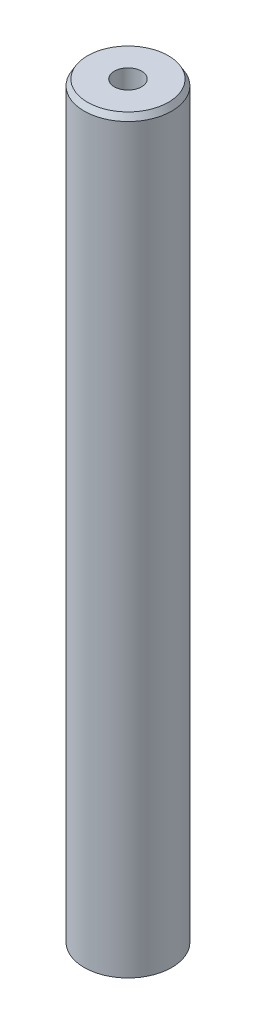
ISO-10303-21;
HEADER;
FILE_DESCRIPTION(('STEP AP214'),'2;1');
FILE_NAME('part.step','',(''),(''),'','','');
FILE_SCHEMA(('AUTOMOTIVE_DESIGN { 1 0 10303 214 1 1 1 1 }'));
ENDSEC;
DATA;
#1=APPLICATION_CONTEXT('core data for automotive mechanical design processes');
#2=APPLICATION_PROTOCOL_DEFINITION('international standard','automotive_design',2000,#1);
#3=PRODUCT_CONTEXT('',#1,'mechanical');
#4=PRODUCT('Part','Part','',(#3));
#5=PRODUCT_RELATED_PRODUCT_CATEGORY('part','',(#4));
#6=PRODUCT_DEFINITION_FORMATION('','',#4);
#7=PRODUCT_DEFINITION_CONTEXT('part definition',#1,'design');
#8=PRODUCT_DEFINITION('design','',#6,#7);
#9=PRODUCT_DEFINITION_SHAPE('','',#8);
#10=(LENGTH_UNIT() NAMED_UNIT(*) SI_UNIT(.MILLI.,.METRE.));
#11=(NAMED_UNIT(*) PLANE_ANGLE_UNIT() SI_UNIT($,.RADIAN.));
#12=(NAMED_UNIT(*) SI_UNIT($,.STERADIAN.) SOLID_ANGLE_UNIT());
#13=UNCERTAINTY_MEASURE_WITH_UNIT(LENGTH_MEASURE(1.E-05),#10,'distance_accuracy_value','');
#14=(GEOMETRIC_REPRESENTATION_CONTEXT(3) GLOBAL_UNCERTAINTY_ASSIGNED_CONTEXT((#13)) GLOBAL_UNIT_ASSIGNED_CONTEXT((#10,
#11,#12)) REPRESENTATION_CONTEXT('',''));
#15=CARTESIAN_POINT('',(0.,0.,0.));
#16=DIRECTION('',(0.,0.,1.));
#17=DIRECTION('',(1.,0.,0.));
#18=AXIS2_PLACEMENT_3D('',#15,#16,#17);
#19=CARTESIAN_POINT('',(0.,600.,0.));
#20=DIRECTION('',(0.,-1.,0.));
#21=DIRECTION('',(0.,0.,-1.));
#22=AXIS2_PLACEMENT_3D('',#19,#20,#21);
#23=CYLINDRICAL_SURFACE('',#22,35.);
#24=CARTESIAN_POINT('',(0.,595.276985216167,0.));
#25=DIRECTION('',(0.,1.,0.));
#26=DIRECTION('',(0.,0.,1.));
#27=AXIS2_PLACEMENT_3D('',#24,#25,#26);
#28=CIRCLE('',#27,35.);
#29=CARTESIAN_POINT('',(0.,595.276985216167,35.));
#30=VERTEX_POINT('',#29);
#31=EDGE_CURVE('E50',#30,#30,#28,.F.);
#32=ORIENTED_EDGE('',*,*,#31,.T.);
#33=EDGE_LOOP('',(#32));
#34=FACE_BOUND('',#33,.T.);
#35=CARTESIAN_POINT('',(0.,2.7268338568327,0.));
#36=DIRECTION('',(0.,1.,0.));
#37=DIRECTION('',(0.,0.,1.));
#38=AXIS2_PLACEMENT_3D('',#35,#36,#37);
#39=CIRCLE('',#38,35.);
#40=CARTESIAN_POINT('',(0.,2.7268338568327,35.));
#41=VERTEX_POINT('',#40);
#42=EDGE_CURVE('E51',#41,#41,#39,.T.);
#43=ORIENTED_EDGE('',*,*,#42,.T.);
#44=EDGE_LOOP('',(#43));
#45=FACE_BOUND('',#44,.T.);
#46=ADVANCED_FACE('F39',(#34,#45),#23,.T.);
#47=CARTESIAN_POINT('',(0.,600.,0.));
#48=DIRECTION('',(0.,1.,0.));
#49=DIRECTION('',(0.,0.,1.));
#50=AXIS2_PLACEMENT_3D('',#47,#48,#49);
#51=PLANE('',#50);
#52=CARTESIAN_POINT('',(0.,600.,0.));
#53=DIRECTION('',(0.,1.,0.));
#54=DIRECTION('',(0.,0.,1.));
#55=AXIS2_PLACEMENT_3D('',#52,#53,#54);
#56=CIRCLE('',#55,32.2731661431673);
#57=CARTESIAN_POINT('',(0.,600.,32.2731661431673));
#58=VERTEX_POINT('',#57);
#59=EDGE_CURVE('E54',#58,#58,#56,.T.);
#60=ORIENTED_EDGE('',*,*,#59,.T.);
#61=EDGE_LOOP('',(#60));
#62=FACE_BOUND('',#61,.T.);
#63=CARTESIAN_POINT('',(0.,600.,0.));
#64=DIRECTION('',(0.,1.,0.));
#65=DIRECTION('',(0.,0.,1.));
#66=AXIS2_PLACEMENT_3D('',#63,#64,#65);
#67=CIRCLE('',#66,10.8830906482456);
#68=CARTESIAN_POINT('',(0.,600.,10.8830906482456));
#69=VERTEX_POINT('',#68);
#70=EDGE_CURVE('E58',#69,#69,#67,.T.);
#71=ORIENTED_EDGE('',*,*,#70,.F.);
#72=EDGE_LOOP('',(#71));
#73=FACE_BOUND('',#72,.T.);
#74=ADVANCED_FACE('F69',(#62,#73),#51,.T.);
#75=CARTESIAN_POINT('',(0.,0.,0.));
#76=DIRECTION('',(0.,1.,0.));
#77=DIRECTION('',(0.,0.,1.));
#78=AXIS2_PLACEMENT_3D('',#75,#76,#77);
#79=PLANE('',#78);
#80=CARTESIAN_POINT('',(0.,0.,0.));
#81=DIRECTION('',(0.,1.,0.));
#82=DIRECTION('',(0.,0.,1.));
#83=AXIS2_PLACEMENT_3D('',#80,#81,#82);
#84=CIRCLE('',#83,30.2769852161667);
#85=CARTESIAN_POINT('',(0.,0.,30.2769852161667));
#86=VERTEX_POINT('',#85);
#87=EDGE_CURVE('E10',#86,#86,#84,.F.);
#88=ORIENTED_EDGE('',*,*,#87,.T.);
#89=EDGE_LOOP('',(#88));
#90=FACE_BOUND('',#89,.T.);
#91=CARTESIAN_POINT('',(0.,0.,0.));
#92=DIRECTION('',(0.,1.,0.));
#93=DIRECTION('',(0.,0.,1.));
#94=AXIS2_PLACEMENT_3D('',#91,#92,#93);
#95=CIRCLE('',#94,10.8830906482456);
#96=CARTESIAN_POINT('',(0.,0.,10.8830906482456));
#97=VERTEX_POINT('',#96);
#98=EDGE_CURVE('E63',#97,#97,#95,.T.);
#99=ORIENTED_EDGE('',*,*,#98,.T.);
#100=EDGE_LOOP('',(#99));
#101=FACE_BOUND('',#100,.T.);
#102=ADVANCED_FACE('F75',(#90,#101),#79,.F.);
#103=CARTESIAN_POINT('',(0.,600.,0.));
#104=DIRECTION('',(0.,-1.,0.));
#105=DIRECTION('',(0.,0.,-1.));
#106=AXIS2_PLACEMENT_3D('',#103,#104,#105);
#107=CYLINDRICAL_SURFACE('',#106,10.8830906482456);
#108=ORIENTED_EDGE('',*,*,#70,.T.);
#109=EDGE_LOOP('',(#108));
#110=FACE_BOUND('',#109,.T.);
#111=ORIENTED_EDGE('',*,*,#98,.F.);
#112=EDGE_LOOP('',(#111));
#113=FACE_BOUND('',#112,.T.);
#114=ADVANCED_FACE('F70',(#110,#113),#107,.F.);
#115=CARTESIAN_POINT('',(0.,600.,0.));
#116=DIRECTION('',(0.,-1.,0.));
#117=DIRECTION('',(0.,0.,-1.));
#118=AXIS2_PLACEMENT_3D('',#115,#116,#117);
#119=CONICAL_SURFACE('',#118,32.2731661431673,0.5235987755983);
#120=ORIENTED_EDGE('',*,*,#31,.F.);
#121=EDGE_LOOP('',(#120));
#122=FACE_BOUND('',#121,.T.);
#123=ORIENTED_EDGE('',*,*,#59,.F.);
#124=EDGE_LOOP('',(#123));
#125=FACE_BOUND('',#124,.T.);
#126=ADVANCED_FACE('F81',(#122,#125),#119,.T.);
#127=CARTESIAN_POINT('',(0.,2.7268338568327,0.));
#128=DIRECTION('',(0.,1.,0.));
#129=DIRECTION('',(0.,0.,1.));
#130=AXIS2_PLACEMENT_3D('',#127,#128,#129);
#131=CONICAL_SURFACE('',#130,35.,1.04719755119661);
#132=ORIENTED_EDGE('',*,*,#87,.F.);
#133=EDGE_LOOP('',(#132));
#134=FACE_BOUND('',#133,.T.);
#135=ORIENTED_EDGE('',*,*,#42,.F.);
#136=EDGE_LOOP('',(#135));
#137=FACE_BOUND('',#136,.T.);
#138=ADVANCED_FACE('F45',(#134,#137),#131,.T.);
#139=CLOSED_SHELL('',(#46,#74,#102,#114,#126,#138));
#140=MANIFOLD_SOLID_BREP('B2',#139);
#141=ADVANCED_BREP_SHAPE_REPRESENTATION('',(#18,#140),#14);
#142=SHAPE_DEFINITION_REPRESENTATION(#9,#141);
ENDSEC;
END-ISO-10303-21;
